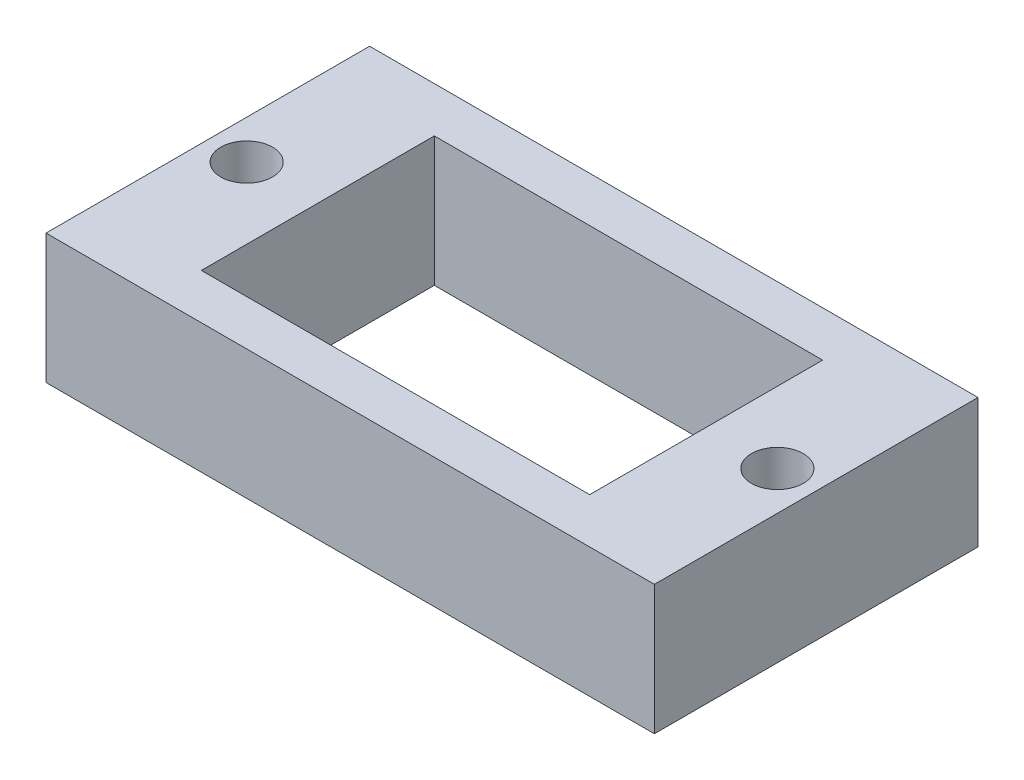
ISO-10303-21;
HEADER;
FILE_DESCRIPTION(('STEP AP214'),'2;1');
FILE_NAME('part.step','',(''),(''),'','','');
FILE_SCHEMA(('AUTOMOTIVE_DESIGN { 1 0 10303 214 1 1 1 1 }'));
ENDSEC;
DATA;
#1=APPLICATION_CONTEXT('core data for automotive mechanical design processes');
#2=APPLICATION_PROTOCOL_DEFINITION('international standard','automotive_design',2000,#1);
#3=PRODUCT_CONTEXT('',#1,'mechanical');
#4=PRODUCT('Part','Part','',(#3));
#5=PRODUCT_RELATED_PRODUCT_CATEGORY('part','',(#4));
#6=PRODUCT_DEFINITION_FORMATION('','',#4);
#7=PRODUCT_DEFINITION_CONTEXT('part definition',#1,'design');
#8=PRODUCT_DEFINITION('design','',#6,#7);
#9=PRODUCT_DEFINITION_SHAPE('','',#8);
#10=(LENGTH_UNIT() NAMED_UNIT(*) SI_UNIT(.MILLI.,.METRE.));
#11=(NAMED_UNIT(*) PLANE_ANGLE_UNIT() SI_UNIT($,.RADIAN.));
#12=(NAMED_UNIT(*) SI_UNIT($,.STERADIAN.) SOLID_ANGLE_UNIT());
#13=UNCERTAINTY_MEASURE_WITH_UNIT(LENGTH_MEASURE(1.E-05),#10,'distance_accuracy_value','');
#14=(GEOMETRIC_REPRESENTATION_CONTEXT(3) GLOBAL_UNCERTAINTY_ASSIGNED_CONTEXT((#13)) GLOBAL_UNIT_ASSIGNED_CONTEXT((#10,
#11,#12)) REPRESENTATION_CONTEXT('',''));
#15=CARTESIAN_POINT('',(0.,0.,0.));
#16=DIRECTION('',(0.,0.,1.));
#17=DIRECTION('',(1.,0.,0.));
#18=AXIS2_PLACEMENT_3D('',#15,#16,#17);
#19=CARTESIAN_POINT('',(0.,10.,0.));
#20=DIRECTION('',(1.,0.,0.));
#21=DIRECTION('',(0.,0.,-1.));
#22=AXIS2_PLACEMENT_3D('',#19,#20,#21);
#23=PLANE('',#22);
#24=DIRECTION('',(0.,0.,1.));
#25=VECTOR('',#24,1.);
#26=CARTESIAN_POINT('',(0.,0.,0.));
#27=LINE('',#26,#25);
#28=CARTESIAN_POINT('',(0.,0.,-25.));
#29=VERTEX_POINT('',#28);
#30=CARTESIAN_POINT('',(0.,0.,0.));
#31=VERTEX_POINT('',#30);
#32=EDGE_CURVE('E142',#29,#31,#27,.T.);
#33=ORIENTED_EDGE('',*,*,#32,.T.);
#34=DIRECTION('',(0.,-1.,0.));
#35=VECTOR('',#34,1.);
#36=CARTESIAN_POINT('',(0.,10.,0.));
#37=LINE('',#36,#35);
#38=CARTESIAN_POINT('',(0.,10.,0.));
#39=VERTEX_POINT('',#38);
#40=EDGE_CURVE('E11',#39,#31,#37,.T.);
#41=ORIENTED_EDGE('',*,*,#40,.F.);
#42=DIRECTION('',(0.,0.,1.));
#43=VECTOR('',#42,1.);
#44=CARTESIAN_POINT('',(0.,10.,0.));
#45=LINE('',#44,#43);
#46=CARTESIAN_POINT('',(0.,10.,-25.));
#47=VERTEX_POINT('',#46);
#48=EDGE_CURVE('E151',#47,#39,#45,.T.);
#49=ORIENTED_EDGE('',*,*,#48,.F.);
#50=DIRECTION('',(0.,-1.,0.));
#51=VECTOR('',#50,1.);
#52=CARTESIAN_POINT('',(0.,10.,-25.));
#53=LINE('',#52,#51);
#54=EDGE_CURVE('E161',#47,#29,#53,.T.);
#55=ORIENTED_EDGE('',*,*,#54,.T.);
#56=EDGE_LOOP('',(#33,#41,#49,#55));
#57=FACE_BOUND('',#56,.T.);
#58=ADVANCED_FACE('F38',(#57),#23,.F.);
#59=CARTESIAN_POINT('',(0.,10.,0.));
#60=DIRECTION('',(0.,0.,-1.));
#61=DIRECTION('',(-1.,0.,0.));
#62=AXIS2_PLACEMENT_3D('',#59,#60,#61);
#63=PLANE('',#62);
#64=DIRECTION('',(1.,0.,0.));
#65=VECTOR('',#64,1.);
#66=CARTESIAN_POINT('',(0.,0.,0.));
#67=LINE('',#66,#65);
#68=CARTESIAN_POINT('',(47.,0.,0.));
#69=VERTEX_POINT('',#68);
#70=EDGE_CURVE('E164',#31,#69,#67,.T.);
#71=ORIENTED_EDGE('',*,*,#70,.T.);
#72=DIRECTION('',(0.,-1.,0.));
#73=VECTOR('',#72,1.);
#74=CARTESIAN_POINT('',(47.,10.,0.));
#75=LINE('',#74,#73);
#76=CARTESIAN_POINT('',(47.,10.,0.));
#77=VERTEX_POINT('',#76);
#78=EDGE_CURVE('E45',#77,#69,#75,.T.);
#79=ORIENTED_EDGE('',*,*,#78,.F.);
#80=DIRECTION('',(1.,0.,0.));
#81=VECTOR('',#80,1.);
#82=CARTESIAN_POINT('',(0.,10.,0.));
#83=LINE('',#82,#81);
#84=EDGE_CURVE('E154',#39,#77,#83,.T.);
#85=ORIENTED_EDGE('',*,*,#84,.F.);
#86=ORIENTED_EDGE('',*,*,#40,.T.);
#87=EDGE_LOOP('',(#71,#79,#85,#86));
#88=FACE_BOUND('',#87,.T.);
#89=ADVANCED_FACE('F192',(#88),#63,.F.);
#90=CARTESIAN_POINT('',(47.,10.,0.));
#91=DIRECTION('',(-1.,0.,0.));
#92=DIRECTION('',(0.,0.,1.));
#93=AXIS2_PLACEMENT_3D('',#90,#91,#92);
#94=PLANE('',#93);
#95=DIRECTION('',(0.,0.,-1.));
#96=VECTOR('',#95,1.);
#97=CARTESIAN_POINT('',(47.,0.,0.));
#98=LINE('',#97,#96);
#99=CARTESIAN_POINT('',(47.,0.,-25.));
#100=VERTEX_POINT('',#99);
#101=EDGE_CURVE('E166',#69,#100,#98,.T.);
#102=ORIENTED_EDGE('',*,*,#101,.T.);
#103=DIRECTION('',(0.,-1.,0.));
#104=VECTOR('',#103,1.);
#105=CARTESIAN_POINT('',(47.,10.,-25.));
#106=LINE('',#105,#104);
#107=CARTESIAN_POINT('',(47.,10.,-25.));
#108=VERTEX_POINT('',#107);
#109=EDGE_CURVE('E171',#108,#100,#106,.T.);
#110=ORIENTED_EDGE('',*,*,#109,.F.);
#111=DIRECTION('',(0.,0.,-1.));
#112=VECTOR('',#111,1.);
#113=CARTESIAN_POINT('',(47.,10.,0.));
#114=LINE('',#113,#112);
#115=EDGE_CURVE('E157',#77,#108,#114,.T.);
#116=ORIENTED_EDGE('',*,*,#115,.F.);
#117=ORIENTED_EDGE('',*,*,#78,.T.);
#118=EDGE_LOOP('',(#102,#110,#116,#117));
#119=FACE_BOUND('',#118,.T.);
#120=ADVANCED_FACE('F178',(#119),#94,.F.);
#121=CARTESIAN_POINT('',(0.,10.,-25.));
#122=DIRECTION('',(0.,0.,1.));
#123=DIRECTION('',(1.,0.,0.));
#124=AXIS2_PLACEMENT_3D('',#121,#122,#123);
#125=PLANE('',#124);
#126=DIRECTION('',(-1.,0.,0.));
#127=VECTOR('',#126,1.);
#128=CARTESIAN_POINT('',(0.,0.,-25.));
#129=LINE('',#128,#127);
#130=EDGE_CURVE('E155',#100,#29,#129,.T.);
#131=ORIENTED_EDGE('',*,*,#130,.T.);
#132=ORIENTED_EDGE('',*,*,#54,.F.);
#133=DIRECTION('',(-1.,0.,0.));
#134=VECTOR('',#133,1.);
#135=CARTESIAN_POINT('',(0.,10.,-25.));
#136=LINE('',#135,#134);
#137=EDGE_CURVE('E159',#108,#47,#136,.T.);
#138=ORIENTED_EDGE('',*,*,#137,.F.);
#139=ORIENTED_EDGE('',*,*,#109,.T.);
#140=EDGE_LOOP('',(#131,#132,#138,#139));
#141=FACE_BOUND('',#140,.T.);
#142=ADVANCED_FACE('F185',(#141),#125,.F.);
#143=CARTESIAN_POINT('',(0.,10.,0.));
#144=DIRECTION('',(0.,-1.,0.));
#145=DIRECTION('',(0.,0.,-1.));
#146=AXIS2_PLACEMENT_3D('',#143,#144,#145);
#147=PLANE('',#146);
#148=DIRECTION('',(1.,0.,0.));
#149=VECTOR('',#148,1.);
#150=CARTESIAN_POINT('',(8.5,10.,-3.5));
#151=LINE('',#150,#149);
#152=CARTESIAN_POINT('',(8.5,10.,-3.5));
#153=VERTEX_POINT('',#152);
#154=CARTESIAN_POINT('',(38.5,10.,-3.5));
#155=VERTEX_POINT('',#154);
#156=EDGE_CURVE('E129',#153,#155,#151,.T.);
#157=ORIENTED_EDGE('',*,*,#156,.F.);
#158=DIRECTION('',(0.,0.,1.));
#159=VECTOR('',#158,1.);
#160=CARTESIAN_POINT('',(8.5,10.,-21.5));
#161=LINE('',#160,#159);
#162=CARTESIAN_POINT('',(8.5,10.,-21.5));
#163=VERTEX_POINT('',#162);
#164=EDGE_CURVE('E52',#163,#153,#161,.T.);
#165=ORIENTED_EDGE('',*,*,#164,.F.);
#166=DIRECTION('',(-1.,0.,0.));
#167=VECTOR('',#166,1.);
#168=CARTESIAN_POINT('',(8.5,10.,-21.5));
#169=LINE('',#168,#167);
#170=CARTESIAN_POINT('',(38.5,10.,-21.5));
#171=VERTEX_POINT('',#170);
#172=EDGE_CURVE('E120',#171,#163,#169,.T.);
#173=ORIENTED_EDGE('',*,*,#172,.F.);
#174=DIRECTION('',(0.,0.,-1.));
#175=VECTOR('',#174,1.);
#176=CARTESIAN_POINT('',(38.5,10.,-21.5));
#177=LINE('',#176,#175);
#178=EDGE_CURVE('E123',#155,#171,#177,.T.);
#179=ORIENTED_EDGE('',*,*,#178,.F.);
#180=EDGE_LOOP('',(#157,#165,#173,#179));
#181=FACE_BOUND('',#180,.T.);
#182=CARTESIAN_POINT('',(3.,10.,-12.5));
#183=DIRECTION('',(0.,1.,0.));
#184=DIRECTION('',(0.,0.,1.));
#185=AXIS2_PLACEMENT_3D('',#182,#183,#184);
#186=CIRCLE('',#185,2.);
#187=CARTESIAN_POINT('',(3.,10.,-10.5));
#188=VERTEX_POINT('',#187);
#189=EDGE_CURVE('E143',#188,#188,#186,.T.);
#190=ORIENTED_EDGE('',*,*,#189,.F.);
#191=EDGE_LOOP('',(#190));
#192=FACE_BOUND('',#191,.T.);
#193=CARTESIAN_POINT('',(44.,10.,-12.5));
#194=DIRECTION('',(0.,1.,0.));
#195=DIRECTION('',(0.,0.,-1.));
#196=AXIS2_PLACEMENT_3D('',#193,#194,#195);
#197=CIRCLE('',#196,2.);
#198=CARTESIAN_POINT('',(44.,10.,-14.5));
#199=VERTEX_POINT('',#198);
#200=EDGE_CURVE('E146',#199,#199,#197,.T.);
#201=ORIENTED_EDGE('',*,*,#200,.F.);
#202=EDGE_LOOP('',(#201));
#203=FACE_BOUND('',#202,.T.);
#204=ORIENTED_EDGE('',*,*,#48,.T.);
#205=ORIENTED_EDGE('',*,*,#84,.T.);
#206=ORIENTED_EDGE('',*,*,#115,.T.);
#207=ORIENTED_EDGE('',*,*,#137,.T.);
#208=EDGE_LOOP('',(#204,#205,#206,#207));
#209=FACE_BOUND('',#208,.T.);
#210=ADVANCED_FACE('F191',(#181,#192,#203,#209),#147,.F.);
#211=CARTESIAN_POINT('',(0.,0.,0.));
#212=DIRECTION('',(0.,-1.,0.));
#213=DIRECTION('',(0.,0.,-1.));
#214=AXIS2_PLACEMENT_3D('',#211,#212,#213);
#215=PLANE('',#214);
#216=DIRECTION('',(0.,0.,1.));
#217=VECTOR('',#216,1.);
#218=CARTESIAN_POINT('',(8.5,0.,-21.5));
#219=LINE('',#218,#217);
#220=CARTESIAN_POINT('',(8.5,0.,-21.5));
#221=VERTEX_POINT('',#220);
#222=CARTESIAN_POINT('',(8.5,0.,-3.5));
#223=VERTEX_POINT('',#222);
#224=EDGE_CURVE('E104',#221,#223,#219,.T.);
#225=ORIENTED_EDGE('',*,*,#224,.T.);
#226=DIRECTION('',(1.,0.,0.));
#227=VECTOR('',#226,1.);
#228=CARTESIAN_POINT('',(8.5,0.,-3.5));
#229=LINE('',#228,#227);
#230=CARTESIAN_POINT('',(38.5,0.,-3.5));
#231=VERTEX_POINT('',#230);
#232=EDGE_CURVE('E113',#223,#231,#229,.T.);
#233=ORIENTED_EDGE('',*,*,#232,.T.);
#234=DIRECTION('',(0.,0.,-1.));
#235=VECTOR('',#234,1.);
#236=CARTESIAN_POINT('',(38.5,0.,-21.5));
#237=LINE('',#236,#235);
#238=CARTESIAN_POINT('',(38.5,0.,-21.5));
#239=VERTEX_POINT('',#238);
#240=EDGE_CURVE('E60',#231,#239,#237,.T.);
#241=ORIENTED_EDGE('',*,*,#240,.T.);
#242=DIRECTION('',(-1.,0.,0.));
#243=VECTOR('',#242,1.);
#244=CARTESIAN_POINT('',(8.5,0.,-21.5));
#245=LINE('',#244,#243);
#246=EDGE_CURVE('E110',#239,#221,#245,.T.);
#247=ORIENTED_EDGE('',*,*,#246,.T.);
#248=EDGE_LOOP('',(#225,#233,#241,#247));
#249=FACE_BOUND('',#248,.T.);
#250=ORIENTED_EDGE('',*,*,#32,.F.);
#251=ORIENTED_EDGE('',*,*,#130,.F.);
#252=ORIENTED_EDGE('',*,*,#101,.F.);
#253=ORIENTED_EDGE('',*,*,#70,.F.);
#254=EDGE_LOOP('',(#250,#251,#252,#253));
#255=FACE_BOUND('',#254,.T.);
#256=ADVANCED_FACE('F117',(#249,#255),#215,.T.);
#257=CARTESIAN_POINT('',(44.,2.,-12.5));
#258=DIRECTION('',(0.,1.,0.));
#259=DIRECTION('',(0.,0.,1.));
#260=AXIS2_PLACEMENT_3D('',#257,#258,#259);
#261=CYLINDRICAL_SURFACE('',#260,2.);
#262=CARTESIAN_POINT('',(44.,2.,-12.5));
#263=DIRECTION('',(0.,1.,0.));
#264=DIRECTION('',(0.,0.,-1.));
#265=AXIS2_PLACEMENT_3D('',#262,#263,#264);
#266=CIRCLE('',#265,2.);
#267=CARTESIAN_POINT('',(44.,2.,-14.5));
#268=VERTEX_POINT('',#267);
#269=EDGE_CURVE('E135',#268,#268,#266,.T.);
#270=ORIENTED_EDGE('',*,*,#269,.F.);
#271=EDGE_LOOP('',(#270));
#272=FACE_BOUND('',#271,.T.);
#273=ORIENTED_EDGE('',*,*,#200,.T.);
#274=EDGE_LOOP('',(#273));
#275=FACE_BOUND('',#274,.T.);
#276=ADVANCED_FACE('F204',(#272,#275),#261,.F.);
#277=CARTESIAN_POINT('',(44.,2.,-12.5));
#278=DIRECTION('',(0.,-1.,0.));
#279=DIRECTION('',(0.,0.,-1.));
#280=AXIS2_PLACEMENT_3D('',#277,#278,#279);
#281=PLANE('',#280);
#282=ORIENTED_EDGE('',*,*,#269,.T.);
#283=EDGE_LOOP('',(#282));
#284=FACE_BOUND('',#283,.T.);
#285=ADVANCED_FACE('F208',(#284),#281,.F.);
#286=CARTESIAN_POINT('',(3.,2.,-12.5));
#287=DIRECTION('',(0.,1.,0.));
#288=DIRECTION('',(0.,0.,1.));
#289=AXIS2_PLACEMENT_3D('',#286,#287,#288);
#290=CYLINDRICAL_SURFACE('',#289,2.);
#291=CARTESIAN_POINT('',(3.,2.,-12.5));
#292=DIRECTION('',(0.,1.,0.));
#293=DIRECTION('',(0.,0.,1.));
#294=AXIS2_PLACEMENT_3D('',#291,#292,#293);
#295=CIRCLE('',#294,2.);
#296=CARTESIAN_POINT('',(3.,2.,-10.5));
#297=VERTEX_POINT('',#296);
#298=EDGE_CURVE('E139',#297,#297,#295,.T.);
#299=ORIENTED_EDGE('',*,*,#298,.F.);
#300=EDGE_LOOP('',(#299));
#301=FACE_BOUND('',#300,.T.);
#302=ORIENTED_EDGE('',*,*,#189,.T.);
#303=EDGE_LOOP('',(#302));
#304=FACE_BOUND('',#303,.T.);
#305=ADVANCED_FACE('F211',(#301,#304),#290,.F.);
#306=CARTESIAN_POINT('',(3.,2.,-12.5));
#307=DIRECTION('',(0.,1.,0.));
#308=DIRECTION('',(0.,0.,1.));
#309=AXIS2_PLACEMENT_3D('',#306,#307,#308);
#310=PLANE('',#309);
#311=ORIENTED_EDGE('',*,*,#298,.T.);
#312=EDGE_LOOP('',(#311));
#313=FACE_BOUND('',#312,.T.);
#314=ADVANCED_FACE('F218',(#313),#310,.T.);
#315=CARTESIAN_POINT('',(8.5,0.,-21.5));
#316=DIRECTION('',(-1.,0.,0.));
#317=DIRECTION('',(0.,0.,1.));
#318=AXIS2_PLACEMENT_3D('',#315,#316,#317);
#319=PLANE('',#318);
#320=ORIENTED_EDGE('',*,*,#164,.T.);
#321=DIRECTION('',(0.,1.,0.));
#322=VECTOR('',#321,1.);
#323=CARTESIAN_POINT('',(8.5,0.,-3.5));
#324=LINE('',#323,#322);
#325=EDGE_CURVE('E100',#223,#153,#324,.T.);
#326=ORIENTED_EDGE('',*,*,#325,.F.);
#327=ORIENTED_EDGE('',*,*,#224,.F.);
#328=DIRECTION('',(0.,1.,0.));
#329=VECTOR('',#328,1.);
#330=CARTESIAN_POINT('',(8.5,0.,-21.5));
#331=LINE('',#330,#329);
#332=EDGE_CURVE('E133',#221,#163,#331,.T.);
#333=ORIENTED_EDGE('',*,*,#332,.T.);
#334=EDGE_LOOP('',(#320,#326,#327,#333));
#335=FACE_BOUND('',#334,.T.);
#336=ADVANCED_FACE('F102',(#335),#319,.F.);
#337=CARTESIAN_POINT('',(8.5,0.,-21.5));
#338=DIRECTION('',(0.,0.,-1.));
#339=DIRECTION('',(-1.,0.,0.));
#340=AXIS2_PLACEMENT_3D('',#337,#338,#339);
#341=PLANE('',#340);
#342=ORIENTED_EDGE('',*,*,#172,.T.);
#343=ORIENTED_EDGE('',*,*,#332,.F.);
#344=ORIENTED_EDGE('',*,*,#246,.F.);
#345=DIRECTION('',(0.,1.,0.));
#346=VECTOR('',#345,1.);
#347=CARTESIAN_POINT('',(38.5,0.,-21.5));
#348=LINE('',#347,#346);
#349=EDGE_CURVE('E136',#239,#171,#348,.T.);
#350=ORIENTED_EDGE('',*,*,#349,.T.);
#351=EDGE_LOOP('',(#342,#343,#344,#350));
#352=FACE_BOUND('',#351,.T.);
#353=ADVANCED_FACE('F225',(#352),#341,.F.);
#354=CARTESIAN_POINT('',(38.5,0.,-21.5));
#355=DIRECTION('',(1.,0.,0.));
#356=DIRECTION('',(0.,0.,-1.));
#357=AXIS2_PLACEMENT_3D('',#354,#355,#356);
#358=PLANE('',#357);
#359=ORIENTED_EDGE('',*,*,#178,.T.);
#360=ORIENTED_EDGE('',*,*,#349,.F.);
#361=ORIENTED_EDGE('',*,*,#240,.F.);
#362=DIRECTION('',(0.,1.,0.));
#363=VECTOR('',#362,1.);
#364=CARTESIAN_POINT('',(38.5,0.,-3.5));
#365=LINE('',#364,#363);
#366=EDGE_CURVE('E109',#231,#155,#365,.T.);
#367=ORIENTED_EDGE('',*,*,#366,.T.);
#368=EDGE_LOOP('',(#359,#360,#361,#367));
#369=FACE_BOUND('',#368,.T.);
#370=ADVANCED_FACE('F228',(#369),#358,.F.);
#371=CARTESIAN_POINT('',(8.5,0.,-3.5));
#372=DIRECTION('',(0.,0.,1.));
#373=DIRECTION('',(1.,0.,0.));
#374=AXIS2_PLACEMENT_3D('',#371,#372,#373);
#375=PLANE('',#374);
#376=ORIENTED_EDGE('',*,*,#156,.T.);
#377=ORIENTED_EDGE('',*,*,#366,.F.);
#378=ORIENTED_EDGE('',*,*,#232,.F.);
#379=ORIENTED_EDGE('',*,*,#325,.T.);
#380=EDGE_LOOP('',(#376,#377,#378,#379));
#381=FACE_BOUND('',#380,.T.);
#382=ADVANCED_FACE('F114',(#381),#375,.F.);
#383=CLOSED_SHELL('',(#58,#89,#120,#142,#210,#256,#276,#285,#305,#314,#336,#353,#370,#382));
#384=MANIFOLD_SOLID_BREP('B2',#383);
#385=ADVANCED_BREP_SHAPE_REPRESENTATION('',(#18,#384),#14);
#386=SHAPE_DEFINITION_REPRESENTATION(#9,#385);
ENDSEC;
END-ISO-10303-21;
